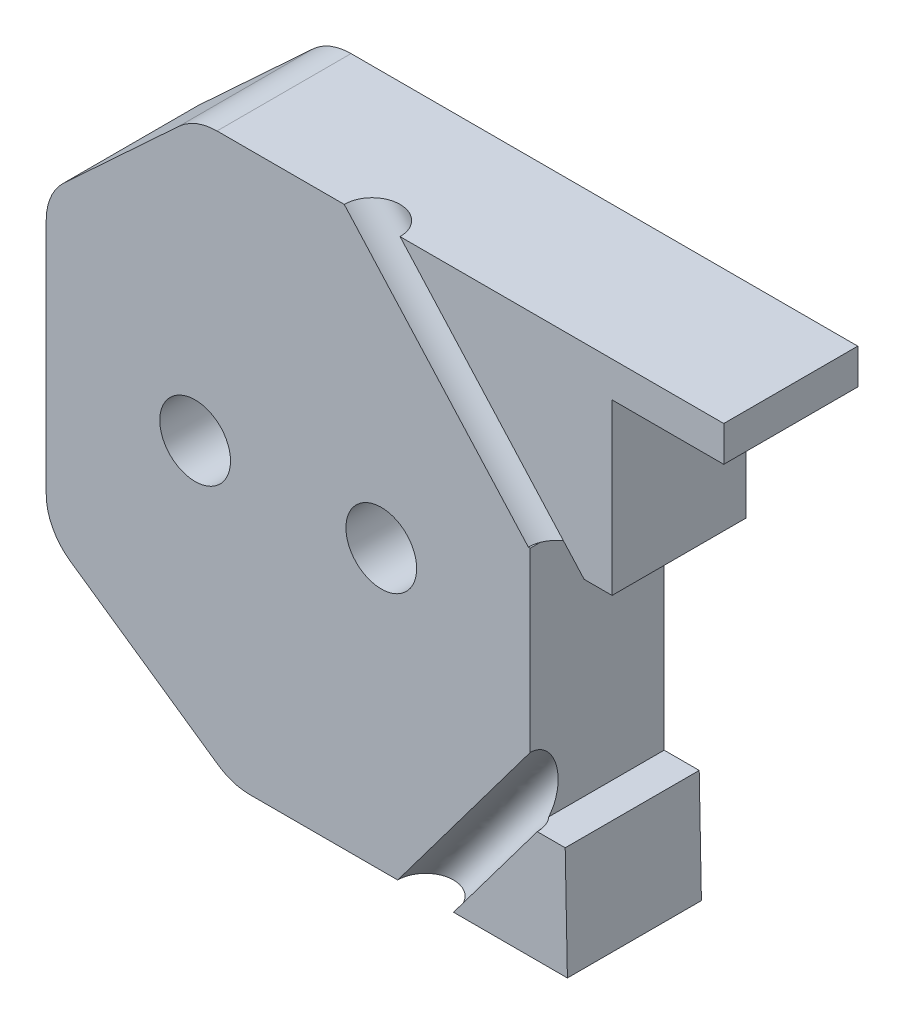
ISO-10303-21;
HEADER;
FILE_DESCRIPTION(('STEP AP214'),'2;1');
FILE_NAME('part.step','',(''),(''),'','','');
FILE_SCHEMA(('AUTOMOTIVE_DESIGN { 1 0 10303 214 1 1 1 1 }'));
ENDSEC;
DATA;
#1=APPLICATION_CONTEXT('core data for automotive mechanical design processes');
#2=APPLICATION_PROTOCOL_DEFINITION('international standard','automotive_design',2000,#1);
#3=PRODUCT_CONTEXT('',#1,'mechanical');
#4=PRODUCT('Part','Part','',(#3));
#5=PRODUCT_RELATED_PRODUCT_CATEGORY('part','',(#4));
#6=PRODUCT_DEFINITION_FORMATION('','',#4);
#7=PRODUCT_DEFINITION_CONTEXT('part definition',#1,'design');
#8=PRODUCT_DEFINITION('design','',#6,#7);
#9=PRODUCT_DEFINITION_SHAPE('','',#8);
#10=(LENGTH_UNIT() NAMED_UNIT(*) SI_UNIT(.MILLI.,.METRE.));
#11=(NAMED_UNIT(*) PLANE_ANGLE_UNIT() SI_UNIT($,.RADIAN.));
#12=(NAMED_UNIT(*) SI_UNIT($,.STERADIAN.) SOLID_ANGLE_UNIT());
#13=UNCERTAINTY_MEASURE_WITH_UNIT(LENGTH_MEASURE(1.E-05),#10,'distance_accuracy_value','');
#14=(GEOMETRIC_REPRESENTATION_CONTEXT(3) GLOBAL_UNCERTAINTY_ASSIGNED_CONTEXT((#13)) GLOBAL_UNIT_ASSIGNED_CONTEXT((#10,
#11,#12)) REPRESENTATION_CONTEXT('',''));
#15=CARTESIAN_POINT('',(0.,0.,0.));
#16=DIRECTION('',(0.,0.,1.));
#17=DIRECTION('',(1.,0.,0.));
#18=AXIS2_PLACEMENT_3D('',#15,#16,#17);
#19=CARTESIAN_POINT('',(0.,0.,4.4));
#20=DIRECTION('',(0.,0.,1.));
#21=DIRECTION('',(1.,0.,0.));
#22=AXIS2_PLACEMENT_3D('',#19,#20,#21);
#23=PLANE('',#22);
#24=CARTESIAN_POINT('',(-11.7,0.,4.4));
#25=DIRECTION('',(0.,0.,1.));
#26=DIRECTION('',(1.,0.,0.));
#27=AXIS2_PLACEMENT_3D('',#24,#25,#26);
#28=CIRCLE('',#27,0.950000000000001);
#29=CARTESIAN_POINT('',(-10.75,0.,4.4));
#30=VERTEX_POINT('',#29);
#31=EDGE_CURVE('E387',#30,#30,#28,.F.);
#32=ORIENTED_EDGE('',*,*,#31,.F.);
#33=EDGE_LOOP('',(#32));
#34=FACE_BOUND('',#33,.T.);
#35=DIRECTION('',(0.,-1.,0.));
#36=VECTOR('',#35,1.);
#37=CARTESIAN_POINT('',(-13.5,0.,4.4));
#38=LINE('',#37,#36);
#39=CARTESIAN_POINT('',(-13.5,5.29999999999999,4.4));
#40=VERTEX_POINT('',#39);
#41=CARTESIAN_POINT('',(-13.5,3.97582151925491,4.4));
#42=VERTEX_POINT('',#41);
#43=EDGE_CURVE('E362',#40,#42,#38,.T.);
#44=ORIENTED_EDGE('',*,*,#43,.T.);
#45=DIRECTION('',(-1.,0.,0.));
#46=VECTOR('',#45,1.);
#47=CARTESIAN_POINT('',(-13.5,3.97582151925491,4.4));
#48=LINE('',#47,#46);
#49=CARTESIAN_POINT('',(-5.5,3.97582151925491,4.4));
#50=VERTEX_POINT('',#49);
#51=EDGE_CURVE('E347',#50,#42,#48,.T.);
#52=ORIENTED_EDGE('',*,*,#51,.F.);
#53=DIRECTION('',(0.,1.,0.));
#54=VECTOR('',#53,1.);
#55=CARTESIAN_POINT('',(-5.5,2.,4.4));
#56=LINE('',#55,#54);
#57=CARTESIAN_POINT('',(-5.5,2.,4.4));
#58=VERTEX_POINT('',#57);
#59=EDGE_CURVE('E397',#58,#50,#56,.T.);
#60=ORIENTED_EDGE('',*,*,#59,.F.);
#61=DIRECTION('',(1.,0.,0.));
#62=VECTOR('',#61,1.);
#63=CARTESIAN_POINT('',(-7.7,2.,4.4));
#64=LINE('',#63,#62);
#65=CARTESIAN_POINT('',(-7.7,2.,4.4));
#66=VERTEX_POINT('',#65);
#67=EDGE_CURVE('E380',#66,#58,#64,.T.);
#68=ORIENTED_EDGE('',*,*,#67,.F.);
#69=DIRECTION('',(0.,1.,0.));
#70=VECTOR('',#69,1.);
#71=CARTESIAN_POINT('',(-7.7,2.,4.4));
#72=LINE('',#71,#70);
#73=CARTESIAN_POINT('',(-7.7,-4.5,4.4));
#74=VERTEX_POINT('',#73);
#75=EDGE_CURVE('E388',#74,#66,#72,.T.);
#76=ORIENTED_EDGE('',*,*,#75,.F.);
#77=DIRECTION('',(-1.,0.,0.));
#78=VECTOR('',#77,1.);
#79=CARTESIAN_POINT('',(-6.75907917408683,-4.5,4.4));
#80=LINE('',#79,#78);
#81=CARTESIAN_POINT('',(-6.75907917408683,-4.5,4.4));
#82=VERTEX_POINT('',#81);
#83=EDGE_CURVE('E355',#82,#74,#80,.T.);
#84=ORIENTED_EDGE('',*,*,#83,.F.);
#85=DIRECTION('',(-0.0196892404925269,0.999806148115137,0.));
#86=VECTOR('',#85,1.);
#87=CARTESIAN_POINT('',(-6.69999999999999,-7.5,4.4));
#88=LINE('',#87,#86);
#89=CARTESIAN_POINT('',(-6.69999999999999,-7.5,4.4));
#90=VERTEX_POINT('',#89);
#91=EDGE_CURVE('E351',#90,#82,#88,.T.);
#92=ORIENTED_EDGE('',*,*,#91,.F.);
#93=DIRECTION('',(1.,0.,0.));
#94=VECTOR('',#93,1.);
#95=CARTESIAN_POINT('',(-15.7,-7.5,4.4));
#96=LINE('',#95,#94);
#97=CARTESIAN_POINT('',(-15.23067743474,-7.5,4.4));
#98=VERTEX_POINT('',#97);
#99=EDGE_CURVE('E384',#98,#90,#96,.T.);
#100=ORIENTED_EDGE('',*,*,#99,.F.);
#101=CARTESIAN_POINT('',(-15.23067743474,-6.,4.4));
#102=DIRECTION('',(0.,0.,1.));
#103=DIRECTION('',(1.,0.,0.));
#104=AXIS2_PLACEMENT_3D('',#101,#102,#103);
#105=CIRCLE('',#104,1.5);
#106=CARTESIAN_POINT('',(-16.0856272804161,-7.23250183017247,4.4));
#107=VERTEX_POINT('',#106);
#108=EDGE_CURVE('E377',#98,#107,#105,.F.);
#109=ORIENTED_EDGE('',*,*,#108,.T.);
#110=DIRECTION('',(0.821667886781642,-0.569966563784045,0.));
#111=VECTOR('',#110,1.);
#112=CARTESIAN_POINT('',(-20.7,-4.03164877833717,4.4));
#113=LINE('',#112,#111);
#114=CARTESIAN_POINT('',(-20.0549498456761,-4.47910087649381,4.4));
#115=VERTEX_POINT('',#114);
#116=EDGE_CURVE('E373',#115,#107,#113,.T.);
#117=ORIENTED_EDGE('',*,*,#116,.F.);
#118=CARTESIAN_POINT('',(-19.2,-3.24659904632135,4.4));
#119=DIRECTION('',(0.,0.,1.));
#120=DIRECTION('',(1.,0.,0.));
#121=AXIS2_PLACEMENT_3D('',#118,#119,#120);
#122=CIRCLE('',#121,1.5);
#123=CARTESIAN_POINT('',(-20.7,-3.24659904632135,4.4));
#124=VERTEX_POINT('',#123);
#125=EDGE_CURVE('E370',#115,#124,#122,.F.);
#126=ORIENTED_EDGE('',*,*,#125,.T.);
#127=DIRECTION('',(0.,-1.,0.));
#128=VECTOR('',#127,1.);
#129=CARTESIAN_POINT('',(-20.7,3.79344266559656,4.4));
#130=LINE('',#129,#128);
#131=CARTESIAN_POINT('',(-20.7,3.13841119589865,4.4));
#132=VERTEX_POINT('',#131);
#133=EDGE_CURVE('E356',#132,#124,#130,.T.);
#134=ORIENTED_EDGE('',*,*,#133,.F.);
#135=CARTESIAN_POINT('',(-19.2,3.13841119589865,4.4));
#136=DIRECTION('',(0.,0.,1.));
#137=DIRECTION('',(1.,0.,0.));
#138=AXIS2_PLACEMENT_3D('',#135,#136,#137);
#139=CIRCLE('',#138,1.5);
#140=CARTESIAN_POINT('',(-20.2195345802764,4.23866082194745,4.4));
#141=VERTEX_POINT('',#140);
#142=EDGE_CURVE('E361',#132,#141,#139,.F.);
#143=ORIENTED_EDGE('',*,*,#142,.T.);
#144=DIRECTION('',(0.733499750699198,0.679689720184301,0.));
#145=VECTOR('',#144,1.);
#146=CARTESIAN_POINT('',(-20.7,3.79344266559656,4.4));
#147=LINE('',#146,#145);
#148=CARTESIAN_POINT('',(-17.131398020196,7.10024962604879,4.4));
#149=VERTEX_POINT('',#148);
#150=EDGE_CURVE('E363',#141,#149,#147,.T.);
#151=ORIENTED_EDGE('',*,*,#150,.T.);
#152=CARTESIAN_POINT('',(-16.1118634399196,6.,4.4));
#153=DIRECTION('',(0.,0.,1.));
#154=DIRECTION('',(1.,0.,0.));
#155=AXIS2_PLACEMENT_3D('',#152,#153,#154);
#156=CIRCLE('',#155,1.5);
#157=CARTESIAN_POINT('',(-16.1118634399196,7.5,4.4));
#158=VERTEX_POINT('',#157);
#159=EDGE_CURVE('E357',#149,#158,#156,.F.);
#160=ORIENTED_EDGE('',*,*,#159,.T.);
#161=DIRECTION('',(-1.,0.,0.));
#162=VECTOR('',#161,1.);
#163=CARTESIAN_POINT('',(-2.5,7.5,4.4));
#164=LINE('',#163,#162);
#165=CARTESIAN_POINT('',(-2.5,7.5,4.4));
#166=VERTEX_POINT('',#165);
#167=EDGE_CURVE('E352',#166,#158,#164,.T.);
#168=ORIENTED_EDGE('',*,*,#167,.F.);
#169=DIRECTION('',(0.,1.,0.));
#170=VECTOR('',#169,1.);
#171=CARTESIAN_POINT('',(-2.5,7.5,4.4));
#172=LINE('',#171,#170);
#173=CARTESIAN_POINT('',(-2.5,6.55,4.4));
#174=VERTEX_POINT('',#173);
#175=EDGE_CURVE('E348',#174,#166,#172,.T.);
#176=ORIENTED_EDGE('',*,*,#175,.F.);
#177=DIRECTION('',(-1.,0.,0.));
#178=VECTOR('',#177,1.);
#179=CARTESIAN_POINT('',(-5.5,6.55,4.4));
#180=LINE('',#179,#178);
#181=CARTESIAN_POINT('',(-5.5,6.55,4.4));
#182=VERTEX_POINT('',#181);
#183=EDGE_CURVE('E51',#174,#182,#180,.T.);
#184=ORIENTED_EDGE('',*,*,#183,.T.);
#185=DIRECTION('',(0.,-1.,0.));
#186=VECTOR('',#185,1.);
#187=CARTESIAN_POINT('',(-5.5,5.3,4.4));
#188=LINE('',#187,#186);
#189=CARTESIAN_POINT('',(-5.5,5.3,4.4));
#190=VERTEX_POINT('',#189);
#191=EDGE_CURVE('E12',#182,#190,#188,.T.);
#192=ORIENTED_EDGE('',*,*,#191,.T.);
#193=DIRECTION('',(1.,0.,0.));
#194=VECTOR('',#193,1.);
#195=CARTESIAN_POINT('',(-5.5,5.3,4.4));
#196=LINE('',#195,#194);
#197=EDGE_CURVE('E59',#40,#190,#196,.T.);
#198=ORIENTED_EDGE('',*,*,#197,.F.);
#199=EDGE_LOOP('',(#44,#52,#60,#68,#76,#84,#92,#100,#109,#117,#126,#134,#143,#151,#160,#168,
#176,#184,#192,#198));
#200=FACE_BOUND('',#199,.T.);
#201=CARTESIAN_POINT('',(-16.7,0.,4.4));
#202=DIRECTION('',(0.,0.,1.));
#203=DIRECTION('',(1.,0.,0.));
#204=AXIS2_PLACEMENT_3D('',#201,#202,#203);
#205=CIRCLE('',#204,0.950000000000001);
#206=CARTESIAN_POINT('',(-15.75,0.,4.4));
#207=VERTEX_POINT('',#206);
#208=EDGE_CURVE('E45',#207,#207,#205,.F.);
#209=ORIENTED_EDGE('',*,*,#208,.F.);
#210=EDGE_LOOP('',(#209));
#211=FACE_BOUND('',#210,.T.);
#212=ADVANCED_FACE('F42',(#34,#200,#211),#23,.F.);
#213=CARTESIAN_POINT('',(-7.,2.,8.));
#214=DIRECTION('',(0.,-1.,0.));
#215=DIRECTION('',(1.,0.,0.));
#216=AXIS2_PLACEMENT_3D('',#213,#214,#215);
#217=PLANE('',#216);
#218=CARTESIAN_POINT('',(-7.,2.,8.));
#219=DIRECTION('',(0.,-1.,0.));
#220=DIRECTION('',(1.,0.,0.));
#221=AXIS2_PLACEMENT_3D('',#218,#219,#220);
#222=CIRCLE('',#221,0.75);
#223=CARTESIAN_POINT('',(-7.75,2.,8.));
#224=VERTEX_POINT('',#223);
#225=CARTESIAN_POINT('',(-7.69999999999999,2.,7.73074175964326));
#226=VERTEX_POINT('',#225);
#227=EDGE_CURVE('E534',#224,#226,#222,.T.);
#228=ORIENTED_EDGE('',*,*,#227,.F.);
#229=DIRECTION('',(-1.,0.,0.));
#230=VECTOR('',#229,1.);
#231=CARTESIAN_POINT('',(0.,2.,8.));
#232=LINE('',#231,#230);
#233=CARTESIAN_POINT('',(-7.7,2.,8.));
#234=VERTEX_POINT('',#233);
#235=EDGE_CURVE('E329',#234,#224,#232,.T.);
#236=ORIENTED_EDGE('',*,*,#235,.F.);
#237=DIRECTION('',(0.,0.,-1.));
#238=VECTOR('',#237,1.);
#239=CARTESIAN_POINT('',(-7.7,2.,8.));
#240=LINE('',#239,#238);
#241=EDGE_CURVE('E286',#234,#226,#240,.T.);
#242=ORIENTED_EDGE('',*,*,#241,.T.);
#243=EDGE_LOOP('',(#228,#236,#242));
#244=FACE_BOUND('',#243,.T.);
#245=ADVANCED_FACE('F418',(#244),#217,.F.);
#246=CARTESIAN_POINT('',(-6.45932091942424,-2.0998187100192,8.));
#247=DIRECTION('',(0.,1.,0.));
#248=DIRECTION('',(-1.,0.,0.));
#249=AXIS2_PLACEMENT_3D('',#246,#247,#248);
#250=CIRCLE('',#249,0.75);
#251=DIRECTION('',(-0.599919418220861,-0.8000604299936,0.));
#252=VECTOR('',#251,1.);
#253=SURFACE_OF_LINEAR_EXTRUSION('',#250,#252);
#254=DIRECTION('',(-0.599919418220861,-0.8000604299936,0.));
#255=VECTOR('',#254,1.);
#256=CARTESIAN_POINT('',(-7.20932091942425,-2.0998187100192,8.));
#257=LINE('',#256,#255);
#258=CARTESIAN_POINT('',(-7.7,-2.75419478832406,8.));
#259=VERTEX_POINT('',#258);
#260=CARTESIAN_POINT('',(-11.2586070687197,-7.5,8.));
#261=VERTEX_POINT('',#260);
#262=EDGE_CURVE('E344',#259,#261,#257,.T.);
#263=ORIENTED_EDGE('',*,*,#262,.T.);
#264=CARTESIAN_POINT('',(-11.2586070687197,-7.5,8.));
#265=CARTESIAN_POINT('',(-11.2586124840592,-7.5,7.97998488609269));
#266=CARTESIAN_POINT('',(-11.2578078698199,-7.5,7.95995918653852));
#267=CARTESIAN_POINT('',(-11.2529839152074,-7.5,7.89995726946848));
#268=CARTESIAN_POINT('',(-11.2465466698463,-7.5,7.86015451597712));
#269=CARTESIAN_POINT('',(-11.2273841248544,-7.5,7.78210733892595));
#270=CARTESIAN_POINT('',(-11.2146588252235,-7.5,7.74386291536613));
#271=CARTESIAN_POINT('',(-11.183252650817,-7.5,7.66989919846503));
#272=CARTESIAN_POINT('',(-11.1645717760414,-7.5,7.63417990512374));
#273=CARTESIAN_POINT('',(-11.1217345529336,-7.50000000000001,7.56619205048089));
#274=CARTESIAN_POINT('',(-11.0975782046014,-7.50000000000001,7.53392348917932));
#275=CARTESIAN_POINT('',(-11.0444136385585,-7.5,7.47366776805683));
#276=CARTESIAN_POINT('',(-11.0154054208477,-7.5,7.4456806082359));
#277=CARTESIAN_POINT('',(-10.9528634198744,-7.5,7.39436454790997));
#278=CARTESIAN_POINT('',(-10.9192739029886,-7.5,7.37110352643513));
#279=CARTESIAN_POINT('',(-10.8487669007805,-7.5,7.33033599433096));
#280=CARTESIAN_POINT('',(-10.8118492564307,-7.5,7.31282975886787));
#281=CARTESIAN_POINT('',(-10.7348731084361,-7.50000000000001,7.28373811492308));
#282=CARTESIAN_POINT('',(-10.6947654667976,-7.50000000000001,7.27228252606906));
#283=CARTESIAN_POINT('',(-10.613208224762,-7.5,7.25616765089136));
#284=CARTESIAN_POINT('',(-10.5717586243649,-7.5,7.25150836456758));
#285=CARTESIAN_POINT('',(-10.4886596860936,-7.5,7.24911396471909));
#286=CARTESIAN_POINT('',(-10.4470103482193,-7.5,7.25137885119437));
#287=CARTESIAN_POINT('',(-10.3646609513695,-7.50000000000001,7.2627705029437));
#288=CARTESIAN_POINT('',(-10.323960892394,-7.50000000000001,7.27189726821773));
#289=CARTESIAN_POINT('',(-10.2446325469492,-7.5,7.29676088957976));
#290=CARTESIAN_POINT('',(-10.2060042604799,-7.5,7.31249774566777));
#291=CARTESIAN_POINT('',(-10.1318848867615,-7.5,7.35014756776158));
#292=CARTESIAN_POINT('',(-10.0963937995123,-7.5,7.37206053376739));
#293=CARTESIAN_POINT('',(-10.0295277614763,-7.50000000000001,7.42145799386608));
#294=CARTESIAN_POINT('',(-9.99815281068937,-7.50000000000001,7.44894248795896));
#295=CARTESIAN_POINT('',(-9.94038422380624,-7.5,7.50872565145884));
#296=CARTESIAN_POINT('',(-9.91399058771001,-7.5,7.54102432086585));
#297=CARTESIAN_POINT('',(-9.86691329978772,-7.5,7.6095423586851));
#298=CARTESIAN_POINT('',(-9.84622964796166,-7.5,7.64576172709734));
#299=CARTESIAN_POINT('',(-9.8111402083156,-7.50000000000001,7.72113201721521));
#300=CARTESIAN_POINT('',(-9.79673442049562,-7.50000000000001,7.76028293892084));
#301=CARTESIAN_POINT('',(-9.77671167900905,-7.5,7.8327818580225));
#302=CARTESIAN_POINT('',(-9.76994433018355,-7.5,7.86581751200977));
#303=CARTESIAN_POINT('',(-9.76088158855058,-7.5,7.93256382389385));
#304=CARTESIAN_POINT('',(-9.75859519460361,-7.5,7.96627570301852));
#305=CARTESIAN_POINT('',(-9.75860706871971,-7.5,7.99999999999978));
#306=B_SPLINE_CURVE_WITH_KNOTS('',3,(#264,#265,#266,#267,#268,#269,#270,#271,#272,#273,#274,
#275,#276,#277,#278,#279,#280,#281,#282,#283,#284,#285,#286,#287,#288,#289,#290,#291,#292,#293,
#294,#295,#296,#297,#298,#299,#300,#301,#302,#303,#304,#305),.UNSPECIFIED.,.F.,.F.,(4,2,2,2,2,2,
2,2,2,2,2,2,2,2,2,2,2,2,2,2,4),(0.,0.0600572216114836,0.180463895512357,0.300870569413232,
0.421277243314105,0.541683917214979,0.662090591115852,0.784120350019278,0.906155942951972,
1.03071321473872,1.15527048652359,1.27982775830845,1.40438503009332,1.52894230187818,
1.65349957366305,1.77805684544791,1.90261411723278,2.02717138901764,2.15172866080251,
2.25259878067893,2.35367126584981),.UNSPECIFIED.);
#307=CARTESIAN_POINT('',(-9.75860706871971,-7.5,8.));
#308=VERTEX_POINT('',#307);
#309=EDGE_CURVE('E508',#261,#308,#306,.T.);
#310=ORIENTED_EDGE('',*,*,#309,.T.);
#311=DIRECTION('',(-0.599919418220861,-0.8000604299936,0.));
#312=VECTOR('',#311,1.);
#313=CARTESIAN_POINT('',(-5.70932091942424,-2.0998187100192,8.));
#314=LINE('',#313,#312);
#315=CARTESIAN_POINT('',(-7.50907917408683,-4.5,8.));
#316=VERTEX_POINT('',#315);
#317=EDGE_CURVE('E341',#308,#316,#314,.F.);
#318=ORIENTED_EDGE('',*,*,#317,.T.);
#319=CARTESIAN_POINT('',(-7.50907917408683,-4.5,8.));
#320=CARTESIAN_POINT('',(-7.50905098866974,-4.5,7.95981423009317));
#321=CARTESIAN_POINT('',(-7.5123075664421,-4.5,7.91964027318381));
#322=CARTESIAN_POINT('',(-7.52518113789138,-4.5,7.84032346745061));
#323=CARTESIAN_POINT('',(-7.53479813156829,-4.5,7.80118061862676));
#324=CARTESIAN_POINT('',(-7.56018342435232,-4.5,7.72493351115516));
#325=CARTESIAN_POINT('',(-7.57595172345944,-4.50000000000001,7.68782925250739));
#326=CARTESIAN_POINT('',(-7.60891232802265,-4.5,7.62484839755682));
#327=CARTESIAN_POINT('',(-7.62493965782727,-4.5,7.59835448661444));
#328=CARTESIAN_POINT('',(-7.66015845255397,-4.5,7.54750122712314));
#329=CARTESIAN_POINT('',(-7.67935468089412,-4.5,7.52314517789494));
#330=CARTESIAN_POINT('',(-7.69999999999996,-4.5,7.50006952773176));
#331=B_SPLINE_CURVE_WITH_KNOTS('',3,(#319,#320,#321,#322,#323,#324,#325,#326,#327,#328,#329,
#330),.UNSPECIFIED.,.F.,.F.,(4,2,2,2,2,4),(0.,0.120406673900874,0.240813347801748,
0.361220021702621,0.453887247128356,0.546695057914633),.UNSPECIFIED.);
#332=CARTESIAN_POINT('',(-7.7,-4.5,7.50006952773171));
#333=VERTEX_POINT('',#332);
#334=EDGE_CURVE('E450',#316,#333,#331,.T.);
#335=ORIENTED_EDGE('',*,*,#334,.T.);
#336=CARTESIAN_POINT('',(-7.7,-4.5,7.50006952773171));
#337=CARTESIAN_POINT('',(-7.70000000000021,-4.4582876083082,7.46516033598755));
#338=CARTESIAN_POINT('',(-7.70000000000024,-4.41356581344674,7.43416853906854));
#339=CARTESIAN_POINT('',(-7.70000000000017,-4.31977985102559,7.37970702446758));
#340=CARTESIAN_POINT('',(-7.70000000000007,-4.27071988067381,7.35623013553038));
#341=CARTESIAN_POINT('',(-7.69999999999999,-4.16987678011414,7.31643159915992));
#342=CARTESIAN_POINT('',(-7.69999999999999,-4.11809522495703,7.30010586314294));
#343=CARTESIAN_POINT('',(-7.7,-4.01288652287046,7.27428954974412));
#344=CARTESIAN_POINT('',(-7.7,-3.9594599126945,7.26479676702043));
#345=CARTESIAN_POINT('',(-7.69999999999999,-3.85186368400761,7.25245427453515));
#346=CARTESIAN_POINT('',(-7.69999999999998,-3.79769417853861,7.24960356512696));
#347=CARTESIAN_POINT('',(-7.70000000000001,-3.68940837177414,7.25048474732423));
#348=CARTESIAN_POINT('',(-7.70000000000006,-3.63529206979426,7.25421655311287));
#349=CARTESIAN_POINT('',(-7.69999999999993,-3.52791814725253,7.26833838799835));
#350=CARTESIAN_POINT('',(-7.69999999999975,-3.47466063180114,7.2787292258751));
#351=CARTESIAN_POINT('',(-7.70000000000017,-3.36991950804024,7.30637540227193));
#352=CARTESIAN_POINT('',(-7.70000000000076,-3.31843640789444,7.3236326897707));
#353=CARTESIAN_POINT('',(-7.69999999999799,-3.21839060238022,7.36533667060647));
#354=CARTESIAN_POINT('',(-7.69999999999463,-3.1698294123588,7.38978705633664));
#355=CARTESIAN_POINT('',(-7.69999999999524,-3.07959407422884,7.44478387351823));
#356=CARTESIAN_POINT('',(-7.69999999999884,-3.03769511902757,7.47495636273544));
#357=CARTESIAN_POINT('',(-7.70000000000099,-2.96522755820841,7.53762452870917));
#358=CARTESIAN_POINT('',(-7.70000000000017,-2.93389343953944,7.56921874458919));
#359=CARTESIAN_POINT('',(-7.69999999999992,-2.89308043123719,7.61831670965024));
#360=CARTESIAN_POINT('',(-7.69999999999998,-2.88117264778514,7.63382949431506));
#361=CARTESIAN_POINT('',(-7.70000000000002,-2.85865931188212,7.66580052934605));
#362=CARTESIAN_POINT('',(-7.7,-2.84805525643048,7.6822598353155));
#363=CARTESIAN_POINT('',(-7.69999999999999,-2.82012214575708,7.73009697877479));
#364=CARTESIAN_POINT('',(-7.69999999999999,-2.80452046132145,7.76251383480192));
#365=CARTESIAN_POINT('',(-7.7,-2.77925094530788,7.82959093047675));
#366=CARTESIAN_POINT('',(-7.69999999999999,-2.76957741112512,7.86424897860057));
#367=CARTESIAN_POINT('',(-7.7,-2.76022684189627,7.91605874286554));
#368=CARTESIAN_POINT('',(-7.7,-2.75796870895701,7.93277267276832));
#369=CARTESIAN_POINT('',(-7.69999999999999,-2.75495230041588,7.96632123750279));
#370=CARTESIAN_POINT('',(-7.69999999999999,-2.75419279406285,7.98315576188169));
#371=CARTESIAN_POINT('',(-7.69999999999996,-2.75419478832404,7.99999999999999));
#372=B_SPLINE_CURVE_WITH_KNOTS('',3,(#336,#337,#338,#339,#340,#341,#342,#343,#344,#345,#346,
#347,#348,#349,#350,#351,#352,#353,#354,#355,#356,#357,#358,#359,#360,#361,#362,#363,#364,#365,
#366,#367,#368,#369,#370,#371),.UNSPECIFIED.,.F.,.F.,(4,2,2,2,2,2,2,2,2,2,2,2,2,2,2,2,2,4),(0.,
0.162659373925204,0.325163060831964,0.4875737165969,0.649931930643277,0.812265707843169,
0.974597368699006,1.13694874945933,1.29934624507965,1.4618272491954,1.61603215668558,
1.74886635959365,1.80747789127961,1.86615610698655,1.97355874018872,2.08085789420783,
2.13139639484744,2.18189337330232),.UNSPECIFIED.);
#373=EDGE_CURVE('E458',#333,#259,#372,.T.);
#374=ORIENTED_EDGE('',*,*,#373,.T.);
#375=EDGE_LOOP('',(#263,#310,#318,#335,#374));
#376=FACE_BOUND('',#375,.T.);
#377=ADVANCED_FACE('F423',(#376),#253,.T.);
#378=CARTESIAN_POINT('',(-12.3486671012521,7.94909743070187,8.));
#379=DIRECTION('',(0.,-1.,0.));
#380=DIRECTION('',(1.,0.,0.));
#381=AXIS2_PLACEMENT_3D('',#378,#379,#380);
#382=CIRCLE('',#381,0.75);
#383=DIRECTION('',(0.668583387656511,-0.743637178837734,0.));
#384=VECTOR('',#383,1.);
#385=SURFACE_OF_LINEAR_EXTRUSION('',#382,#384);
#386=CARTESIAN_POINT('',(-12.6948961627471,7.5,8.));
#387=CARTESIAN_POINT('',(-12.6949107317308,7.5,7.9649335595143));
#388=CARTESIAN_POINT('',(-12.6924371931296,7.5,7.92987937083706));
#389=CARTESIAN_POINT('',(-12.6826411543538,7.5,7.86053660084123));
#390=CARTESIAN_POINT('',(-12.6753297615011,7.5,7.82624645132607));
#391=CARTESIAN_POINT('',(-12.6541661345373,7.5,7.75268705408098));
#392=CARTESIAN_POINT('',(-12.6393427787579,7.5,7.71369338933246));
#393=CARTESIAN_POINT('',(-12.6034498493232,7.5,7.63870319714973));
#394=CARTESIAN_POINT('',(-12.582380275668,7.5,7.60270666971551));
#395=CARTESIAN_POINT('',(-12.5345733841573,7.5,7.53469547524251));
#396=CARTESIAN_POINT('',(-12.5078360663019,7.5,7.50268080820373));
#397=CARTESIAN_POINT('',(-12.4494318490082,7.5,7.44351851560202));
#398=CARTESIAN_POINT('',(-12.4177649495699,7.5,7.4163708900391));
#399=CARTESIAN_POINT('',(-12.3503747946751,7.5,7.36769086647405));
#400=CARTESIAN_POINT('',(-12.3146515392186,7.5,7.34615846847192));
#401=CARTESIAN_POINT('',(-12.2401340192324,7.5,7.30930294891998));
#402=CARTESIAN_POINT('',(-12.2013397547028,7.5,7.29397982737016));
#403=CARTESIAN_POINT('',(-12.1217502014344,7.5,7.2699654510822));
#404=CARTESIAN_POINT('',(-12.0809549126956,7.5,7.26127419634405));
#405=CARTESIAN_POINT('',(-11.9984885039952,7.5,7.25076328275431));
#406=CARTESIAN_POINT('',(-11.9568173840337,7.5,7.24894362390272));
#407=CARTESIAN_POINT('',(-11.8737486585426,7.5,7.25222608303147));
#408=CARTESIAN_POINT('',(-11.832351053013,7.5,7.25732820101181));
#409=CARTESIAN_POINT('',(-11.7509711567693,7.5,7.27431350886432));
#410=CARTESIAN_POINT('',(-11.7109888660551,7.5,7.28619669873648));
#411=CARTESIAN_POINT('',(-11.6335423729543,7.5,7.31641632996126));
#412=CARTESIAN_POINT('',(-11.5960781705676,7.5,7.33475277131389));
#413=CARTESIAN_POINT('',(-11.5247011389757,7.5,7.37737340672296));
#414=CARTESIAN_POINT('',(-11.4907883097705,7.5,7.40165760077941));
#415=CARTESIAN_POINT('',(-11.427449493715,7.5,7.45550303572093));
#416=CARTESIAN_POINT('',(-11.3980235068648,7.5,7.48506427660599));
#417=CARTESIAN_POINT('',(-11.3444695837883,7.5,7.54865188014051));
#418=CARTESIAN_POINT('',(-11.320341647562,7.5,7.58267824278995));
#419=CARTESIAN_POINT('',(-11.27805080135,7.5,7.65424485494965));
#420=CARTESIAN_POINT('',(-11.2598878913643,7.5,7.69178510445991));
#421=CARTESIAN_POINT('',(-11.2287397500523,7.5,7.77272485471587));
#422=CARTESIAN_POINT('',(-11.2163333068544,7.5,7.81635066242785));
#423=CARTESIAN_POINT('',(-11.203626360133,7.5,7.8835410091204));
#424=CARTESIAN_POINT('',(-11.2003728256633,7.5,7.90658587326494));
#425=CARTESIAN_POINT('',(-11.1959983478301,7.5,7.95308133691964));
#426=CARTESIAN_POINT('',(-11.1948963754628,7.5,7.9765337222926));
#427=CARTESIAN_POINT('',(-11.1948961627471,7.5,8.));
#428=B_SPLINE_CURVE_WITH_KNOTS('',3,(#386,#387,#388,#389,#390,#391,#392,#393,#394,#395,#396,
#397,#398,#399,#400,#401,#402,#403,#404,#405,#406,#407,#408,#409,#410,#411,#412,#413,#414,#415,
#416,#417,#418,#419,#420,#421,#422,#423,#424,#425,#426,#427),.UNSPECIFIED.,.F.,.F.,(4,2,2,2,2,2,
2,2,2,2,2,2,2,2,2,2,2,2,2,2,4),(0.,0.105089952449635,0.209939460191808,0.334496731976901,
0.459054003761767,0.583611275546635,0.7081685473315,0.832725819116365,0.957283090901232,
1.0818403626861,1.20639763447096,1.33095490625583,1.4555121780407,1.58006944982556,
1.70462672161043,1.82918399339529,1.95374126518016,2.07829853696503,2.21355535149251,
2.28328860390967,2.35363398806214),.UNSPECIFIED.);
#429=CARTESIAN_POINT('',(-12.6948961627471,7.5,8.));
#430=VERTEX_POINT('',#429);
#431=CARTESIAN_POINT('',(-11.1948961627471,7.5,8.));
#432=VERTEX_POINT('',#431);
#433=EDGE_CURVE('E524',#430,#432,#428,.T.);
#434=ORIENTED_EDGE('',*,*,#433,.F.);
#435=DIRECTION('',(0.668583387656511,-0.743637178837734,0.));
#436=VECTOR('',#435,1.);
#437=CARTESIAN_POINT('',(-13.0986671012521,7.94909743070187,8.));
#438=LINE('',#437,#436);
#439=EDGE_CURVE('E333',#224,#430,#438,.F.);
#440=ORIENTED_EDGE('',*,*,#439,.F.);
#441=ORIENTED_EDGE('',*,*,#227,.T.);
#442=CARTESIAN_POINT('',(-6.25,2.,8.));
#443=VERTEX_POINT('',#442);
#444=EDGE_CURVE('E515',#226,#443,#222,.T.);
#445=ORIENTED_EDGE('',*,*,#444,.T.);
#446=DIRECTION('',(0.668583387656511,-0.743637178837734,0.));
#447=VECTOR('',#446,1.);
#448=CARTESIAN_POINT('',(-11.5986671012521,7.94909743070187,8.));
#449=LINE('',#448,#447);
#450=EDGE_CURVE('E337',#432,#443,#449,.T.);
#451=ORIENTED_EDGE('',*,*,#450,.F.);
#452=EDGE_LOOP('',(#434,#440,#441,#445,#451));
#453=FACE_BOUND('',#452,.T.);
#454=ADVANCED_FACE('F440',(#453),#385,.F.);
#455=CARTESIAN_POINT('',(-7.7,2.,8.));
#456=DIRECTION('',(-1.,0.,0.));
#457=DIRECTION('',(0.,0.,1.));
#458=AXIS2_PLACEMENT_3D('',#455,#456,#457);
#459=PLANE('',#458);
#460=DIRECTION('',(0.,0.,-1.));
#461=VECTOR('',#460,1.);
#462=CARTESIAN_POINT('',(-7.7,-4.5,8.));
#463=LINE('',#462,#461);
#464=EDGE_CURVE('E267',#333,#74,#463,.T.);
#465=ORIENTED_EDGE('',*,*,#464,.T.);
#466=ORIENTED_EDGE('',*,*,#75,.T.);
#467=EDGE_CURVE('E285',#226,#66,#240,.T.);
#468=ORIENTED_EDGE('',*,*,#467,.F.);
#469=ORIENTED_EDGE('',*,*,#241,.F.);
#470=DIRECTION('',(0.,1.,0.));
#471=VECTOR('',#470,1.);
#472=CARTESIAN_POINT('',(-7.7,2.,8.));
#473=LINE('',#472,#471);
#474=EDGE_CURVE('E588',#259,#234,#473,.T.);
#475=ORIENTED_EDGE('',*,*,#474,.F.);
#476=ORIENTED_EDGE('',*,*,#373,.F.);
#477=EDGE_LOOP('',(#465,#466,#468,#469,#475,#476));
#478=FACE_BOUND('',#477,.T.);
#479=ADVANCED_FACE('F495',(#478),#459,.F.);
#480=CARTESIAN_POINT('',(0.,0.,8.));
#481=DIRECTION('',(0.,0.,-1.));
#482=DIRECTION('',(-1.,0.,0.));
#483=AXIS2_PLACEMENT_3D('',#480,#481,#482);
#484=PLANE('',#483);
#485=ORIENTED_EDGE('',*,*,#317,.F.);
#486=DIRECTION('',(1.,0.,0.));
#487=VECTOR('',#486,1.);
#488=CARTESIAN_POINT('',(-15.7,-7.5,8.));
#489=LINE('',#488,#487);
#490=CARTESIAN_POINT('',(-6.69999999999999,-7.5,8.));
#491=VERTEX_POINT('',#490);
#492=EDGE_CURVE('E255',#308,#491,#489,.T.);
#493=ORIENTED_EDGE('',*,*,#492,.T.);
#494=DIRECTION('',(-0.0196892404925269,0.999806148115137,0.));
#495=VECTOR('',#494,1.);
#496=CARTESIAN_POINT('',(-6.69999999999999,-7.5,8.));
#497=LINE('',#496,#495);
#498=CARTESIAN_POINT('',(-6.75907917408683,-4.5,8.));
#499=VERTEX_POINT('',#498);
#500=EDGE_CURVE('E260',#491,#499,#497,.T.);
#501=ORIENTED_EDGE('',*,*,#500,.T.);
#502=DIRECTION('',(-1.,0.,0.));
#503=VECTOR('',#502,1.);
#504=CARTESIAN_POINT('',(-6.75907917408683,-4.5,8.));
#505=LINE('',#504,#503);
#506=EDGE_CURVE('E263',#499,#316,#505,.T.);
#507=ORIENTED_EDGE('',*,*,#506,.T.);
#508=EDGE_LOOP('',(#485,#493,#501,#507));
#509=FACE_BOUND('',#508,.T.);
#510=ADVANCED_FACE('F472',(#509),#484,.F.);
#511=CARTESIAN_POINT('',(-6.75907917408683,-4.5,8.));
#512=DIRECTION('',(0.,-1.,0.));
#513=DIRECTION('',(0.,0.,-1.));
#514=AXIS2_PLACEMENT_3D('',#511,#512,#513);
#515=PLANE('',#514);
#516=DIRECTION('',(0.,0.,-1.));
#517=VECTOR('',#516,1.);
#518=CARTESIAN_POINT('',(-6.75907917408683,-4.5,8.));
#519=LINE('',#518,#517);
#520=EDGE_CURVE('E271',#499,#82,#519,.T.);
#521=ORIENTED_EDGE('',*,*,#520,.T.);
#522=ORIENTED_EDGE('',*,*,#83,.T.);
#523=ORIENTED_EDGE('',*,*,#464,.F.);
#524=ORIENTED_EDGE('',*,*,#334,.F.);
#525=ORIENTED_EDGE('',*,*,#506,.F.);
#526=EDGE_LOOP('',(#521,#522,#523,#524,#525));
#527=FACE_BOUND('',#526,.T.);
#528=ADVANCED_FACE('F466',(#527),#515,.F.);
#529=CARTESIAN_POINT('',(-2.5,7.5,2.));
#530=DIRECTION('',(0.,-1.,0.));
#531=DIRECTION('',(0.,0.,-1.));
#532=AXIS2_PLACEMENT_3D('',#529,#530,#531);
#533=PLANE('',#532);
#534=DIRECTION('',(0.,0.,-1.));
#535=VECTOR('',#534,1.);
#536=CARTESIAN_POINT('',(-2.5,7.5,8.));
#537=LINE('',#536,#535);
#538=CARTESIAN_POINT('',(-2.5,7.5,8.));
#539=VERTEX_POINT('',#538);
#540=EDGE_CURVE('E228',#539,#166,#537,.T.);
#541=ORIENTED_EDGE('',*,*,#540,.T.);
#542=ORIENTED_EDGE('',*,*,#167,.T.);
#543=DIRECTION('',(0.,0.,-1.));
#544=VECTOR('',#543,1.);
#545=CARTESIAN_POINT('',(-16.1118634399196,7.5,8.));
#546=LINE('',#545,#544);
#547=CARTESIAN_POINT('',(-16.1118634399196,7.5,8.));
#548=VERTEX_POINT('',#547);
#549=EDGE_CURVE('E293',#158,#548,#546,.F.);
#550=ORIENTED_EDGE('',*,*,#549,.T.);
#551=DIRECTION('',(-1.,0.,0.));
#552=VECTOR('',#551,1.);
#553=CARTESIAN_POINT('',(-16.7,7.5,8.));
#554=LINE('',#553,#552);
#555=EDGE_CURVE('E231',#430,#548,#554,.T.);
#556=ORIENTED_EDGE('',*,*,#555,.F.);
#557=ORIENTED_EDGE('',*,*,#433,.T.);
#558=EDGE_CURVE('E236',#539,#432,#554,.T.);
#559=ORIENTED_EDGE('',*,*,#558,.F.);
#560=EDGE_LOOP('',(#541,#542,#550,#556,#557,#559));
#561=FACE_BOUND('',#560,.T.);
#562=ADVANCED_FACE('F471',(#561),#533,.F.);
#563=CARTESIAN_POINT('',(-20.7,3.79344266559656,2.));
#564=DIRECTION('',(-0.679689720184301,0.733499750699198,0.));
#565=DIRECTION('',(-0.733499750699198,-0.679689720184301,0.));
#566=AXIS2_PLACEMENT_3D('',#563,#564,#565);
#567=PLANE('',#566);
#568=ORIENTED_EDGE('',*,*,#150,.F.);
#569=DIRECTION('',(0.,0.,-1.));
#570=VECTOR('',#569,1.);
#571=CARTESIAN_POINT('',(-20.2195345802764,4.23866082194745,8.));
#572=LINE('',#571,#570);
#573=CARTESIAN_POINT('',(-20.2195345802764,4.23866082194745,8.));
#574=VERTEX_POINT('',#573);
#575=EDGE_CURVE('E300',#141,#574,#572,.F.);
#576=ORIENTED_EDGE('',*,*,#575,.T.);
#577=DIRECTION('',(-0.733499750699198,-0.679689720184301,0.));
#578=VECTOR('',#577,1.);
#579=CARTESIAN_POINT('',(-16.7,7.5,8.));
#580=LINE('',#579,#578);
#581=CARTESIAN_POINT('',(-17.131398020196,7.10024962604879,8.));
#582=VERTEX_POINT('',#581);
#583=EDGE_CURVE('E243',#582,#574,#580,.T.);
#584=ORIENTED_EDGE('',*,*,#583,.F.);
#585=DIRECTION('',(0.,0.,-1.));
#586=VECTOR('',#585,1.);
#587=CARTESIAN_POINT('',(-17.131398020196,7.10024962604879,0.));
#588=LINE('',#587,#586);
#589=EDGE_CURVE('E296',#582,#149,#588,.T.);
#590=ORIENTED_EDGE('',*,*,#589,.T.);
#591=EDGE_LOOP('',(#568,#576,#584,#590));
#592=FACE_BOUND('',#591,.T.);
#593=ADVANCED_FACE('F541',(#592),#567,.T.);
#594=CARTESIAN_POINT('',(-20.7,3.79344266559656,2.));
#595=DIRECTION('',(1.,0.,0.));
#596=DIRECTION('',(0.,1.,0.));
#597=AXIS2_PLACEMENT_3D('',#594,#595,#596);
#598=PLANE('',#597);
#599=DIRECTION('',(0.,0.,-1.));
#600=VECTOR('',#599,1.);
#601=CARTESIAN_POINT('',(-20.7,3.13841119589865,0.));
#602=LINE('',#601,#600);
#603=CARTESIAN_POINT('',(-20.7,3.13841119589865,8.));
#604=VERTEX_POINT('',#603);
#605=EDGE_CURVE('E310',#604,#132,#602,.T.);
#606=ORIENTED_EDGE('',*,*,#605,.T.);
#607=ORIENTED_EDGE('',*,*,#133,.T.);
#608=DIRECTION('',(0.,0.,-1.));
#609=VECTOR('',#608,1.);
#610=CARTESIAN_POINT('',(-20.7,-3.24659904632135,2.));
#611=LINE('',#610,#609);
#612=CARTESIAN_POINT('',(-20.7,-3.24659904632135,8.));
#613=VERTEX_POINT('',#612);
#614=EDGE_CURVE('E314',#124,#613,#611,.F.);
#615=ORIENTED_EDGE('',*,*,#614,.T.);
#616=DIRECTION('',(0.,-1.,0.));
#617=VECTOR('',#616,1.);
#618=CARTESIAN_POINT('',(-20.7,-4.03164877833717,8.));
#619=LINE('',#618,#617);
#620=EDGE_CURVE('E247',#604,#613,#619,.T.);
#621=ORIENTED_EDGE('',*,*,#620,.F.);
#622=EDGE_LOOP('',(#606,#607,#615,#621));
#623=FACE_BOUND('',#622,.T.);
#624=ADVANCED_FACE('F571',(#623),#598,.F.);
#625=CARTESIAN_POINT('',(-20.7,-4.03164877833717,2.));
#626=DIRECTION('',(0.569966563784045,0.821667886781642,0.));
#627=DIRECTION('',(-0.821667886781642,0.569966563784045,0.));
#628=AXIS2_PLACEMENT_3D('',#625,#626,#627);
#629=PLANE('',#628);
#630=DIRECTION('',(0.,0.,-1.));
#631=VECTOR('',#630,1.);
#632=CARTESIAN_POINT('',(-20.0549498456761,-4.47910087649381,2.));
#633=LINE('',#632,#631);
#634=CARTESIAN_POINT('',(-20.0549498456761,-4.47910087649381,8.));
#635=VERTEX_POINT('',#634);
#636=EDGE_CURVE('E303',#635,#115,#633,.T.);
#637=ORIENTED_EDGE('',*,*,#636,.T.);
#638=ORIENTED_EDGE('',*,*,#116,.T.);
#639=DIRECTION('',(0.,0.,-1.));
#640=VECTOR('',#639,1.);
#641=CARTESIAN_POINT('',(-16.0856272804161,-7.23250183017247,2.));
#642=LINE('',#641,#640);
#643=CARTESIAN_POINT('',(-16.0856272804161,-7.23250183017247,8.));
#644=VERTEX_POINT('',#643);
#645=EDGE_CURVE('E307',#107,#644,#642,.F.);
#646=ORIENTED_EDGE('',*,*,#645,.T.);
#647=DIRECTION('',(0.821667886781642,-0.569966563784045,0.));
#648=VECTOR('',#647,1.);
#649=CARTESIAN_POINT('',(-20.7,-4.03164877833717,8.));
#650=LINE('',#649,#648);
#651=EDGE_CURVE('E251',#635,#644,#650,.T.);
#652=ORIENTED_EDGE('',*,*,#651,.F.);
#653=EDGE_LOOP('',(#637,#638,#646,#652));
#654=FACE_BOUND('',#653,.T.);
#655=ADVANCED_FACE('F506',(#654),#629,.F.);
#656=CARTESIAN_POINT('',(-11.7,0.,8.));
#657=DIRECTION('',(0.,0.,1.));
#658=DIRECTION('',(1.,0.,0.));
#659=AXIS2_PLACEMENT_3D('',#656,#657,#658);
#660=CIRCLE('',#659,0.950000000000001);
#661=CARTESIAN_POINT('',(-10.75,0.,8.));
#662=VERTEX_POINT('',#661);
#663=EDGE_CURVE('E459',#662,#662,#660,.T.);
#664=ORIENTED_EDGE('',*,*,#663,.F.);
#665=EDGE_LOOP('',(#664));
#666=FACE_BOUND('',#665,.T.);
#667=CARTESIAN_POINT('',(-16.7,0.,8.));
#668=DIRECTION('',(0.,0.,1.));
#669=DIRECTION('',(1.,0.,0.));
#670=AXIS2_PLACEMENT_3D('',#667,#668,#669);
#671=CIRCLE('',#670,0.950000000000001);
#672=CARTESIAN_POINT('',(-15.75,0.,8.));
#673=VERTEX_POINT('',#672);
#674=EDGE_CURVE('E448',#673,#673,#671,.T.);
#675=ORIENTED_EDGE('',*,*,#674,.F.);
#676=EDGE_LOOP('',(#675));
#677=FACE_BOUND('',#676,.T.);
#678=ORIENTED_EDGE('',*,*,#262,.F.);
#679=ORIENTED_EDGE('',*,*,#474,.T.);
#680=ORIENTED_EDGE('',*,*,#235,.T.);
#681=ORIENTED_EDGE('',*,*,#439,.T.);
#682=ORIENTED_EDGE('',*,*,#555,.T.);
#683=CARTESIAN_POINT('',(-16.1118634399196,6.,8.));
#684=DIRECTION('',(0.,0.,-1.));
#685=DIRECTION('',(-1.,0.,0.));
#686=AXIS2_PLACEMENT_3D('',#683,#684,#685);
#687=CIRCLE('',#686,1.5);
#688=EDGE_CURVE('E317',#548,#582,#687,.F.);
#689=ORIENTED_EDGE('',*,*,#688,.T.);
#690=ORIENTED_EDGE('',*,*,#583,.T.);
#691=CARTESIAN_POINT('',(-19.2,3.13841119589865,8.));
#692=DIRECTION('',(0.,0.,-1.));
#693=DIRECTION('',(-1.,0.,0.));
#694=AXIS2_PLACEMENT_3D('',#691,#692,#693);
#695=CIRCLE('',#694,1.5);
#696=EDGE_CURVE('E320',#574,#604,#695,.F.);
#697=ORIENTED_EDGE('',*,*,#696,.T.);
#698=ORIENTED_EDGE('',*,*,#620,.T.);
#699=CARTESIAN_POINT('',(-19.2,-3.24659904632135,8.));
#700=DIRECTION('',(0.,0.,-1.));
#701=DIRECTION('',(-1.,0.,0.));
#702=AXIS2_PLACEMENT_3D('',#699,#700,#701);
#703=CIRCLE('',#702,1.5);
#704=EDGE_CURVE('E323',#613,#635,#703,.F.);
#705=ORIENTED_EDGE('',*,*,#704,.T.);
#706=ORIENTED_EDGE('',*,*,#651,.T.);
#707=CARTESIAN_POINT('',(-15.23067743474,-6.,8.));
#708=DIRECTION('',(0.,0.,-1.));
#709=DIRECTION('',(-1.,0.,0.));
#710=AXIS2_PLACEMENT_3D('',#707,#708,#709);
#711=CIRCLE('',#710,1.5);
#712=CARTESIAN_POINT('',(-15.23067743474,-7.5,8.));
#713=VERTEX_POINT('',#712);
#714=EDGE_CURVE('E326',#644,#713,#711,.F.);
#715=ORIENTED_EDGE('',*,*,#714,.T.);
#716=EDGE_CURVE('E256',#713,#261,#489,.T.);
#717=ORIENTED_EDGE('',*,*,#716,.T.);
#718=EDGE_LOOP('',(#678,#679,#680,#681,#682,#689,#690,#697,#698,#705,#706,#715,#717));
#719=FACE_BOUND('',#718,.T.);
#720=ADVANCED_FACE('F474',(#666,#677,#719),#484,.F.);
#721=CARTESIAN_POINT('',(-15.7,-7.5,2.));
#722=DIRECTION('',(0.,1.,0.));
#723=DIRECTION('',(-1.,0.,0.));
#724=AXIS2_PLACEMENT_3D('',#721,#722,#723);
#725=PLANE('',#724);
#726=DIRECTION('',(0.,0.,-1.));
#727=VECTOR('',#726,1.);
#728=CARTESIAN_POINT('',(-15.23067743474,-7.5,2.));
#729=LINE('',#728,#727);
#730=EDGE_CURVE('E289',#713,#98,#729,.T.);
#731=ORIENTED_EDGE('',*,*,#730,.T.);
#732=ORIENTED_EDGE('',*,*,#99,.T.);
#733=DIRECTION('',(0.,0.,-1.));
#734=VECTOR('',#733,1.);
#735=CARTESIAN_POINT('',(-6.69999999999999,-7.5,8.));
#736=LINE('',#735,#734);
#737=EDGE_CURVE('E275',#491,#90,#736,.T.);
#738=ORIENTED_EDGE('',*,*,#737,.F.);
#739=ORIENTED_EDGE('',*,*,#492,.F.);
#740=ORIENTED_EDGE('',*,*,#309,.F.);
#741=ORIENTED_EDGE('',*,*,#716,.F.);
#742=EDGE_LOOP('',(#731,#732,#738,#739,#740,#741));
#743=FACE_BOUND('',#742,.T.);
#744=ADVANCED_FACE('F500',(#743),#725,.F.);
#745=CARTESIAN_POINT('',(-15.23067743474,-6.,2.));
#746=DIRECTION('',(0.,0.,-1.));
#747=DIRECTION('',(-1.,0.,0.));
#748=AXIS2_PLACEMENT_3D('',#745,#746,#747);
#749=CYLINDRICAL_SURFACE('',#748,1.5);
#750=ORIENTED_EDGE('',*,*,#108,.F.);
#751=ORIENTED_EDGE('',*,*,#730,.F.);
#752=ORIENTED_EDGE('',*,*,#714,.F.);
#753=ORIENTED_EDGE('',*,*,#645,.F.);
#754=EDGE_LOOP('',(#750,#751,#752,#753));
#755=FACE_BOUND('',#754,.T.);
#756=ADVANCED_FACE('F504',(#755),#749,.T.);
#757=CARTESIAN_POINT('',(-19.2,-3.24659904632135,2.));
#758=DIRECTION('',(0.,0.,-1.));
#759=DIRECTION('',(-1.,0.,0.));
#760=AXIS2_PLACEMENT_3D('',#757,#758,#759);
#761=CYLINDRICAL_SURFACE('',#760,1.5);
#762=ORIENTED_EDGE('',*,*,#125,.F.);
#763=ORIENTED_EDGE('',*,*,#636,.F.);
#764=ORIENTED_EDGE('',*,*,#704,.F.);
#765=ORIENTED_EDGE('',*,*,#614,.F.);
#766=EDGE_LOOP('',(#762,#763,#764,#765));
#767=FACE_BOUND('',#766,.T.);
#768=ADVANCED_FACE('F545',(#767),#761,.T.);
#769=CARTESIAN_POINT('',(-19.2,3.13841119589865,2.));
#770=DIRECTION('',(0.,0.,1.));
#771=DIRECTION('',(1.,0.,0.));
#772=AXIS2_PLACEMENT_3D('',#769,#770,#771);
#773=CYLINDRICAL_SURFACE('',#772,1.5);
#774=ORIENTED_EDGE('',*,*,#142,.F.);
#775=ORIENTED_EDGE('',*,*,#605,.F.);
#776=ORIENTED_EDGE('',*,*,#696,.F.);
#777=ORIENTED_EDGE('',*,*,#575,.F.);
#778=EDGE_LOOP('',(#774,#775,#776,#777));
#779=FACE_BOUND('',#778,.T.);
#780=ADVANCED_FACE('F549',(#779),#773,.T.);
#781=CARTESIAN_POINT('',(-16.1118634399196,6.,2.));
#782=DIRECTION('',(0.,0.,1.));
#783=DIRECTION('',(1.,0.,0.));
#784=AXIS2_PLACEMENT_3D('',#781,#782,#783);
#785=CYLINDRICAL_SURFACE('',#784,1.5);
#786=ORIENTED_EDGE('',*,*,#159,.F.);
#787=ORIENTED_EDGE('',*,*,#589,.F.);
#788=ORIENTED_EDGE('',*,*,#688,.F.);
#789=ORIENTED_EDGE('',*,*,#549,.F.);
#790=EDGE_LOOP('',(#786,#787,#788,#789));
#791=FACE_BOUND('',#790,.T.);
#792=ADVANCED_FACE('F480',(#791),#785,.T.);
#793=CARTESIAN_POINT('',(-6.69999999999999,-7.5,8.));
#794=DIRECTION('',(-0.999806148115137,-0.0196892404925269,0.));
#795=DIRECTION('',(0.0196892404925269,-0.999806148115137,0.));
#796=AXIS2_PLACEMENT_3D('',#793,#794,#795);
#797=PLANE('',#796);
#798=ORIENTED_EDGE('',*,*,#737,.T.);
#799=ORIENTED_EDGE('',*,*,#91,.T.);
#800=ORIENTED_EDGE('',*,*,#520,.F.);
#801=ORIENTED_EDGE('',*,*,#500,.F.);
#802=EDGE_LOOP('',(#798,#799,#800,#801));
#803=FACE_BOUND('',#802,.T.);
#804=ADVANCED_FACE('F476',(#803),#797,.F.);
#805=CARTESIAN_POINT('',(-5.5,5.3,8.));
#806=DIRECTION('',(0.,1.,0.));
#807=DIRECTION('',(-1.,0.,0.));
#808=AXIS2_PLACEMENT_3D('',#805,#806,#807);
#809=PLANE('',#808);
#810=DIRECTION('',(0.,0.,1.));
#811=VECTOR('',#810,1.);
#812=CARTESIAN_POINT('',(-13.5,5.29999999999999,4.46589940564022));
#813=LINE('',#812,#811);
#814=CARTESIAN_POINT('',(-13.5,5.29999999999999,4.46589940564022));
#815=VERTEX_POINT('',#814);
#816=EDGE_CURVE('E615',#40,#815,#813,.T.);
#817=ORIENTED_EDGE('',*,*,#816,.F.);
#818=ORIENTED_EDGE('',*,*,#197,.T.);
#819=DIRECTION('',(0.,0.,1.));
#820=VECTOR('',#819,1.);
#821=CARTESIAN_POINT('',(-5.5,5.3,4.4));
#822=LINE('',#821,#820);
#823=CARTESIAN_POINT('',(-5.5,5.3,4.46589940564022));
#824=VERTEX_POINT('',#823);
#825=EDGE_CURVE('E214',#190,#824,#822,.T.);
#826=ORIENTED_EDGE('',*,*,#825,.T.);
#827=DIRECTION('',(1.,0.,0.));
#828=VECTOR('',#827,1.);
#829=CARTESIAN_POINT('',(-13.5,5.29999999999999,4.46589940564022));
#830=LINE('',#829,#828);
#831=EDGE_CURVE('E599',#815,#824,#830,.T.);
#832=ORIENTED_EDGE('',*,*,#831,.F.);
#833=EDGE_LOOP('',(#817,#818,#826,#832));
#834=FACE_BOUND('',#833,.T.);
#835=ADVANCED_FACE('F479',(#834),#809,.F.);
#836=CARTESIAN_POINT('',(-13.5,3.97582151925491,4.46589940564022));
#837=DIRECTION('',(0.,0.,1.));
#838=DIRECTION('',(1.,0.,0.));
#839=AXIS2_PLACEMENT_3D('',#836,#837,#838);
#840=PLANE('',#839);
#841=DIRECTION('',(0.,-1.,0.));
#842=VECTOR('',#841,1.);
#843=CARTESIAN_POINT('',(-5.5,3.97582151925491,4.46589940564022));
#844=LINE('',#843,#842);
#845=CARTESIAN_POINT('',(-5.5,3.97582151925491,4.46589940564022));
#846=VERTEX_POINT('',#845);
#847=EDGE_CURVE('E606',#824,#846,#844,.T.);
#848=ORIENTED_EDGE('',*,*,#847,.T.);
#849=DIRECTION('',(1.,0.,0.));
#850=VECTOR('',#849,1.);
#851=CARTESIAN_POINT('',(-13.5,3.97582151925491,4.46589940564022));
#852=LINE('',#851,#850);
#853=CARTESIAN_POINT('',(-13.5,3.97582151925491,4.46589940564022));
#854=VERTEX_POINT('',#853);
#855=EDGE_CURVE('E595',#854,#846,#852,.T.);
#856=ORIENTED_EDGE('',*,*,#855,.F.);
#857=DIRECTION('',(0.,-1.,0.));
#858=VECTOR('',#857,1.);
#859=CARTESIAN_POINT('',(-13.5,3.97582151925491,4.46589940564022));
#860=LINE('',#859,#858);
#861=EDGE_CURVE('E604',#815,#854,#860,.T.);
#862=ORIENTED_EDGE('',*,*,#861,.F.);
#863=ORIENTED_EDGE('',*,*,#831,.T.);
#864=EDGE_LOOP('',(#848,#856,#862,#863));
#865=FACE_BOUND('',#864,.T.);
#866=ADVANCED_FACE('F488',(#865),#840,.F.);
#867=CARTESIAN_POINT('',(-13.5,3.97582151925491,4.46589940564022));
#868=DIRECTION('',(0.,-1.,0.));
#869=DIRECTION('',(0.,0.,-1.));
#870=AXIS2_PLACEMENT_3D('',#867,#868,#869);
#871=PLANE('',#870);
#872=DIRECTION('',(0.,0.,-1.));
#873=VECTOR('',#872,1.);
#874=CARTESIAN_POINT('',(-5.5,3.97582151925491,4.46589940564022));
#875=LINE('',#874,#873);
#876=EDGE_CURVE('E533',#846,#50,#875,.T.);
#877=ORIENTED_EDGE('',*,*,#876,.T.);
#878=ORIENTED_EDGE('',*,*,#51,.T.);
#879=DIRECTION('',(0.,0.,-1.));
#880=VECTOR('',#879,1.);
#881=CARTESIAN_POINT('',(-13.5,3.97582151925491,4.46589940564022));
#882=LINE('',#881,#880);
#883=EDGE_CURVE('E535',#854,#42,#882,.T.);
#884=ORIENTED_EDGE('',*,*,#883,.F.);
#885=ORIENTED_EDGE('',*,*,#855,.T.);
#886=EDGE_LOOP('',(#877,#878,#884,#885));
#887=FACE_BOUND('',#886,.T.);
#888=ADVANCED_FACE('F493',(#887),#871,.F.);
#889=CARTESIAN_POINT('',(-7.7,2.,8.));
#890=DIRECTION('',(0.,1.,0.));
#891=DIRECTION('',(0.,0.,1.));
#892=AXIS2_PLACEMENT_3D('',#889,#890,#891);
#893=PLANE('',#892);
#894=ORIENTED_EDGE('',*,*,#467,.T.);
#895=ORIENTED_EDGE('',*,*,#67,.T.);
#896=DIRECTION('',(0.,0.,-1.));
#897=VECTOR('',#896,1.);
#898=CARTESIAN_POINT('',(-5.5,2.,8.));
#899=LINE('',#898,#897);
#900=CARTESIAN_POINT('',(-5.5,2.,8.));
#901=VERTEX_POINT('',#900);
#902=EDGE_CURVE('E281',#901,#58,#899,.T.);
#903=ORIENTED_EDGE('',*,*,#902,.F.);
#904=DIRECTION('',(1.,0.,0.));
#905=VECTOR('',#904,1.);
#906=CARTESIAN_POINT('',(-7.7,2.,8.));
#907=LINE('',#906,#905);
#908=EDGE_CURVE('E238',#443,#901,#907,.T.);
#909=ORIENTED_EDGE('',*,*,#908,.F.);
#910=ORIENTED_EDGE('',*,*,#444,.F.);
#911=EDGE_LOOP('',(#894,#895,#903,#909,#910));
#912=FACE_BOUND('',#911,.T.);
#913=ADVANCED_FACE('F485',(#912),#893,.F.);
#914=CARTESIAN_POINT('',(-2.5,7.5,8.));
#915=DIRECTION('',(-1.,0.,0.));
#916=DIRECTION('',(0.,0.,1.));
#917=AXIS2_PLACEMENT_3D('',#914,#915,#916);
#918=PLANE('',#917);
#919=DIRECTION('',(0.,0.,1.));
#920=VECTOR('',#919,1.);
#921=CARTESIAN_POINT('',(-2.5,6.55,4.4));
#922=LINE('',#921,#920);
#923=CARTESIAN_POINT('',(-2.5,6.55,8.));
#924=VERTEX_POINT('',#923);
#925=EDGE_CURVE('E206',#174,#924,#922,.T.);
#926=ORIENTED_EDGE('',*,*,#925,.F.);
#927=ORIENTED_EDGE('',*,*,#175,.T.);
#928=ORIENTED_EDGE('',*,*,#540,.F.);
#929=DIRECTION('',(0.,1.,0.));
#930=VECTOR('',#929,1.);
#931=CARTESIAN_POINT('',(-2.5,7.5,8.));
#932=LINE('',#931,#930);
#933=EDGE_CURVE('E219',#924,#539,#932,.T.);
#934=ORIENTED_EDGE('',*,*,#933,.F.);
#935=EDGE_LOOP('',(#926,#927,#928,#934));
#936=FACE_BOUND('',#935,.T.);
#937=ADVANCED_FACE('F226',(#936),#918,.F.);
#938=CARTESIAN_POINT('',(-5.5,2.,8.));
#939=DIRECTION('',(-1.,0.,0.));
#940=DIRECTION('',(0.,-1.,0.));
#941=AXIS2_PLACEMENT_3D('',#938,#939,#940);
#942=PLANE('',#941);
#943=ORIENTED_EDGE('',*,*,#902,.T.);
#944=ORIENTED_EDGE('',*,*,#59,.T.);
#945=ORIENTED_EDGE('',*,*,#876,.F.);
#946=ORIENTED_EDGE('',*,*,#847,.F.);
#947=ORIENTED_EDGE('',*,*,#825,.F.);
#948=ORIENTED_EDGE('',*,*,#191,.F.);
#949=DIRECTION('',(0.,0.,1.));
#950=VECTOR('',#949,1.);
#951=CARTESIAN_POINT('',(-5.5,6.55,4.4));
#952=LINE('',#951,#950);
#953=CARTESIAN_POINT('',(-5.5,6.55,8.));
#954=VERTEX_POINT('',#953);
#955=EDGE_CURVE('E213',#182,#954,#952,.T.);
#956=ORIENTED_EDGE('',*,*,#955,.T.);
#957=DIRECTION('',(0.,1.,0.));
#958=VECTOR('',#957,1.);
#959=CARTESIAN_POINT('',(-5.5,2.,8.));
#960=LINE('',#959,#958);
#961=EDGE_CURVE('E222',#901,#954,#960,.T.);
#962=ORIENTED_EDGE('',*,*,#961,.F.);
#963=EDGE_LOOP('',(#943,#944,#945,#946,#947,#948,#956,#962));
#964=FACE_BOUND('',#963,.T.);
#965=ADVANCED_FACE('F484',(#964),#942,.F.);
#966=ORIENTED_EDGE('',*,*,#961,.T.);
#967=DIRECTION('',(-1.,0.,0.));
#968=VECTOR('',#967,1.);
#969=CARTESIAN_POINT('',(-5.5,6.55,8.));
#970=LINE('',#969,#968);
#971=EDGE_CURVE('E209',#924,#954,#970,.T.);
#972=ORIENTED_EDGE('',*,*,#971,.F.);
#973=ORIENTED_EDGE('',*,*,#933,.T.);
#974=ORIENTED_EDGE('',*,*,#558,.T.);
#975=ORIENTED_EDGE('',*,*,#450,.T.);
#976=ORIENTED_EDGE('',*,*,#908,.T.);
#977=EDGE_LOOP('',(#966,#972,#973,#974,#975,#976));
#978=FACE_BOUND('',#977,.T.);
#979=ADVANCED_FACE('F217',(#978),#484,.F.);
#980=CARTESIAN_POINT('',(-5.5,6.55,4.4));
#981=DIRECTION('',(0.,1.,0.));
#982=DIRECTION('',(-1.,0.,0.));
#983=AXIS2_PLACEMENT_3D('',#980,#981,#982);
#984=PLANE('',#983);
#985=ORIENTED_EDGE('',*,*,#971,.T.);
#986=ORIENTED_EDGE('',*,*,#955,.F.);
#987=ORIENTED_EDGE('',*,*,#183,.F.);
#988=ORIENTED_EDGE('',*,*,#925,.T.);
#989=EDGE_LOOP('',(#985,#986,#987,#988));
#990=FACE_BOUND('',#989,.T.);
#991=ADVANCED_FACE('F208',(#990),#984,.F.);
#992=CARTESIAN_POINT('',(-13.5,0.,0.));
#993=DIRECTION('',(1.,0.,0.));
#994=DIRECTION('',(0.,0.,-1.));
#995=AXIS2_PLACEMENT_3D('',#992,#993,#994);
#996=PLANE('',#995);
#997=ORIENTED_EDGE('',*,*,#43,.F.);
#998=ORIENTED_EDGE('',*,*,#816,.T.);
#999=ORIENTED_EDGE('',*,*,#861,.T.);
#1000=ORIENTED_EDGE('',*,*,#883,.T.);
#1001=EDGE_LOOP('',(#997,#998,#999,#1000));
#1002=FACE_BOUND('',#1001,.T.);
#1003=ADVANCED_FACE('F433',(#1002),#996,.T.);
#1004=CARTESIAN_POINT('',(-11.7,0.,0.));
#1005=DIRECTION('',(0.,0.,1.));
#1006=DIRECTION('',(1.,0.,0.));
#1007=AXIS2_PLACEMENT_3D('',#1004,#1005,#1006);
#1008=CYLINDRICAL_SURFACE('',#1007,0.950000000000001);
#1009=ORIENTED_EDGE('',*,*,#31,.T.);
#1010=EDGE_LOOP('',(#1009));
#1011=FACE_BOUND('',#1010,.T.);
#1012=ORIENTED_EDGE('',*,*,#663,.T.);
#1013=EDGE_LOOP('',(#1012));
#1014=FACE_BOUND('',#1013,.T.);
#1015=ADVANCED_FACE('F428',(#1011,#1014),#1008,.F.);
#1016=CARTESIAN_POINT('',(-16.7,0.,0.));
#1017=DIRECTION('',(0.,0.,1.));
#1018=DIRECTION('',(1.,0.,0.));
#1019=AXIS2_PLACEMENT_3D('',#1016,#1017,#1018);
#1020=CYLINDRICAL_SURFACE('',#1019,0.950000000000001);
#1021=ORIENTED_EDGE('',*,*,#208,.T.);
#1022=EDGE_LOOP('',(#1021));
#1023=FACE_BOUND('',#1022,.T.);
#1024=ORIENTED_EDGE('',*,*,#674,.T.);
#1025=EDGE_LOOP('',(#1024));
#1026=FACE_BOUND('',#1025,.T.);
#1027=ADVANCED_FACE('F414',(#1023,#1026),#1020,.F.);
#1028=CLOSED_SHELL('',(#212,#245,#377,#454,#479,#510,#528,#562,#593,#624,#655,#720,#744,#756,
#768,#780,#792,#804,#835,#866,#888,#913,#937,#965,#979,#991,#1003,#1015,#1027));
#1029=MANIFOLD_SOLID_BREP('B2',#1028);
#1030=ADVANCED_BREP_SHAPE_REPRESENTATION('',(#18,#1029),#14);
#1031=SHAPE_DEFINITION_REPRESENTATION(#9,#1030);
ENDSEC;
END-ISO-10303-21;
